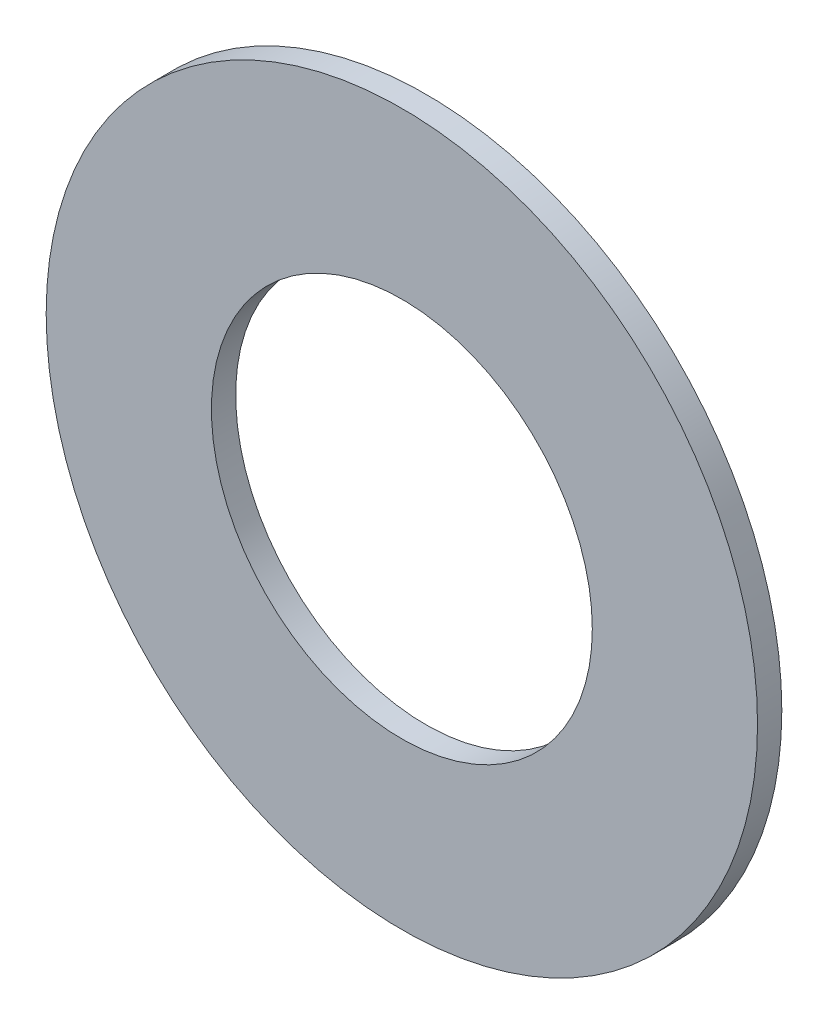
ISO-10303-21;
HEADER;
FILE_DESCRIPTION(('STEP AP214'),'2;1');
FILE_NAME('part.step','',(''),(''),'','','');
FILE_SCHEMA(('AUTOMOTIVE_DESIGN { 1 0 10303 214 1 1 1 1 }'));
ENDSEC;
DATA;
#1=APPLICATION_CONTEXT('core data for automotive mechanical design processes');
#2=APPLICATION_PROTOCOL_DEFINITION('international standard','automotive_design',2000,#1);
#3=PRODUCT_CONTEXT('',#1,'mechanical');
#4=PRODUCT('Part','Part','',(#3));
#5=PRODUCT_RELATED_PRODUCT_CATEGORY('part','',(#4));
#6=PRODUCT_DEFINITION_FORMATION('','',#4);
#7=PRODUCT_DEFINITION_CONTEXT('part definition',#1,'design');
#8=PRODUCT_DEFINITION('design','',#6,#7);
#9=PRODUCT_DEFINITION_SHAPE('','',#8);
#10=(LENGTH_UNIT() NAMED_UNIT(*) SI_UNIT(.MILLI.,.METRE.));
#11=(NAMED_UNIT(*) PLANE_ANGLE_UNIT() SI_UNIT($,.RADIAN.));
#12=(NAMED_UNIT(*) SI_UNIT($,.STERADIAN.) SOLID_ANGLE_UNIT());
#13=UNCERTAINTY_MEASURE_WITH_UNIT(LENGTH_MEASURE(1.E-05),#10,'distance_accuracy_value','');
#14=(GEOMETRIC_REPRESENTATION_CONTEXT(3) GLOBAL_UNCERTAINTY_ASSIGNED_CONTEXT((#13)) GLOBAL_UNIT_ASSIGNED_CONTEXT((#10,
#11,#12)) REPRESENTATION_CONTEXT('',''));
#15=CARTESIAN_POINT('',(0.,0.,0.));
#16=DIRECTION('',(0.,0.,1.));
#17=DIRECTION('',(1.,0.,0.));
#18=AXIS2_PLACEMENT_3D('',#15,#16,#17);
#19=CARTESIAN_POINT('',(0.,0.,-0.406399999999996));
#20=DIRECTION('',(0.,0.,1.));
#21=DIRECTION('',(1.,0.,0.));
#22=AXIS2_PLACEMENT_3D('',#19,#20,#21);
#23=CYLINDRICAL_SURFACE('',#22,11.90625);
#24=CARTESIAN_POINT('',(0.,0.,-0.406399999999996));
#25=DIRECTION('',(0.,0.,1.));
#26=DIRECTION('',(1.,0.,0.));
#27=AXIS2_PLACEMENT_3D('',#24,#25,#26);
#28=CIRCLE('',#27,11.90625);
#29=CARTESIAN_POINT('',(11.90625,0.,-0.406399999999996));
#30=VERTEX_POINT('',#29);
#31=EDGE_CURVE('E10',#30,#30,#28,.T.);
#32=ORIENTED_EDGE('',*,*,#31,.T.);
#33=EDGE_LOOP('',(#32));
#34=FACE_BOUND('',#33,.T.);
#35=CARTESIAN_POINT('',(0.,0.,0.406400000000004));
#36=DIRECTION('',(0.,0.,1.));
#37=DIRECTION('',(1.,0.,0.));
#38=AXIS2_PLACEMENT_3D('',#35,#36,#37);
#39=CIRCLE('',#38,11.90625);
#40=CARTESIAN_POINT('',(11.90625,0.,0.406400000000004));
#41=VERTEX_POINT('',#40);
#42=EDGE_CURVE('E45',#41,#41,#39,.T.);
#43=ORIENTED_EDGE('',*,*,#42,.F.);
#44=EDGE_LOOP('',(#43));
#45=FACE_BOUND('',#44,.T.);
#46=ADVANCED_FACE('F35',(#34,#45),#23,.T.);
#47=CARTESIAN_POINT('',(0.,0.,-0.406399999999996));
#48=DIRECTION('',(0.,0.,1.));
#49=DIRECTION('',(1.,0.,0.));
#50=AXIS2_PLACEMENT_3D('',#47,#48,#49);
#51=PLANE('',#50);
#52=CARTESIAN_POINT('',(0.,0.,-0.406399999999996));
#53=DIRECTION('',(0.,0.,1.));
#54=DIRECTION('',(1.,0.,0.));
#55=AXIS2_PLACEMENT_3D('',#52,#53,#54);
#56=CIRCLE('',#55,6.3754);
#57=CARTESIAN_POINT('',(6.3754,0.,-0.406399999999996));
#58=VERTEX_POINT('',#57);
#59=EDGE_CURVE('E41',#58,#58,#56,.T.);
#60=ORIENTED_EDGE('',*,*,#59,.T.);
#61=EDGE_LOOP('',(#60));
#62=FACE_BOUND('',#61,.T.);
#63=ORIENTED_EDGE('',*,*,#31,.F.);
#64=EDGE_LOOP('',(#63));
#65=FACE_BOUND('',#64,.T.);
#66=ADVANCED_FACE('F64',(#62,#65),#51,.F.);
#67=CARTESIAN_POINT('',(0.,0.,-0.406399999999996));
#68=DIRECTION('',(0.,0.,1.));
#69=DIRECTION('',(1.,0.,0.));
#70=AXIS2_PLACEMENT_3D('',#67,#68,#69);
#71=CYLINDRICAL_SURFACE('',#70,6.3754);
#72=ORIENTED_EDGE('',*,*,#59,.F.);
#73=EDGE_LOOP('',(#72));
#74=FACE_BOUND('',#73,.T.);
#75=CARTESIAN_POINT('',(0.,0.,0.406400000000004));
#76=DIRECTION('',(0.,0.,1.));
#77=DIRECTION('',(1.,0.,0.));
#78=AXIS2_PLACEMENT_3D('',#75,#76,#77);
#79=CIRCLE('',#78,6.3754);
#80=CARTESIAN_POINT('',(6.3754,0.,0.406400000000004));
#81=VERTEX_POINT('',#80);
#82=EDGE_CURVE('E49',#81,#81,#79,.T.);
#83=ORIENTED_EDGE('',*,*,#82,.T.);
#84=EDGE_LOOP('',(#83));
#85=FACE_BOUND('',#84,.T.);
#86=ADVANCED_FACE('F55',(#74,#85),#71,.F.);
#87=CARTESIAN_POINT('',(0.,0.,0.406400000000004));
#88=DIRECTION('',(0.,0.,1.));
#89=DIRECTION('',(1.,0.,0.));
#90=AXIS2_PLACEMENT_3D('',#87,#88,#89);
#91=PLANE('',#90);
#92=ORIENTED_EDGE('',*,*,#42,.T.);
#93=EDGE_LOOP('',(#92));
#94=FACE_BOUND('',#93,.T.);
#95=ORIENTED_EDGE('',*,*,#82,.F.);
#96=EDGE_LOOP('',(#95));
#97=FACE_BOUND('',#96,.T.);
#98=ADVANCED_FACE('F57',(#94,#97),#91,.T.);
#99=CLOSED_SHELL('',(#46,#66,#86,#98));
#100=MANIFOLD_SOLID_BREP('B2',#99);
#101=ADVANCED_BREP_SHAPE_REPRESENTATION('',(#18,#100),#14);
#102=SHAPE_DEFINITION_REPRESENTATION(#9,#101);
ENDSEC;
END-ISO-10303-21;
